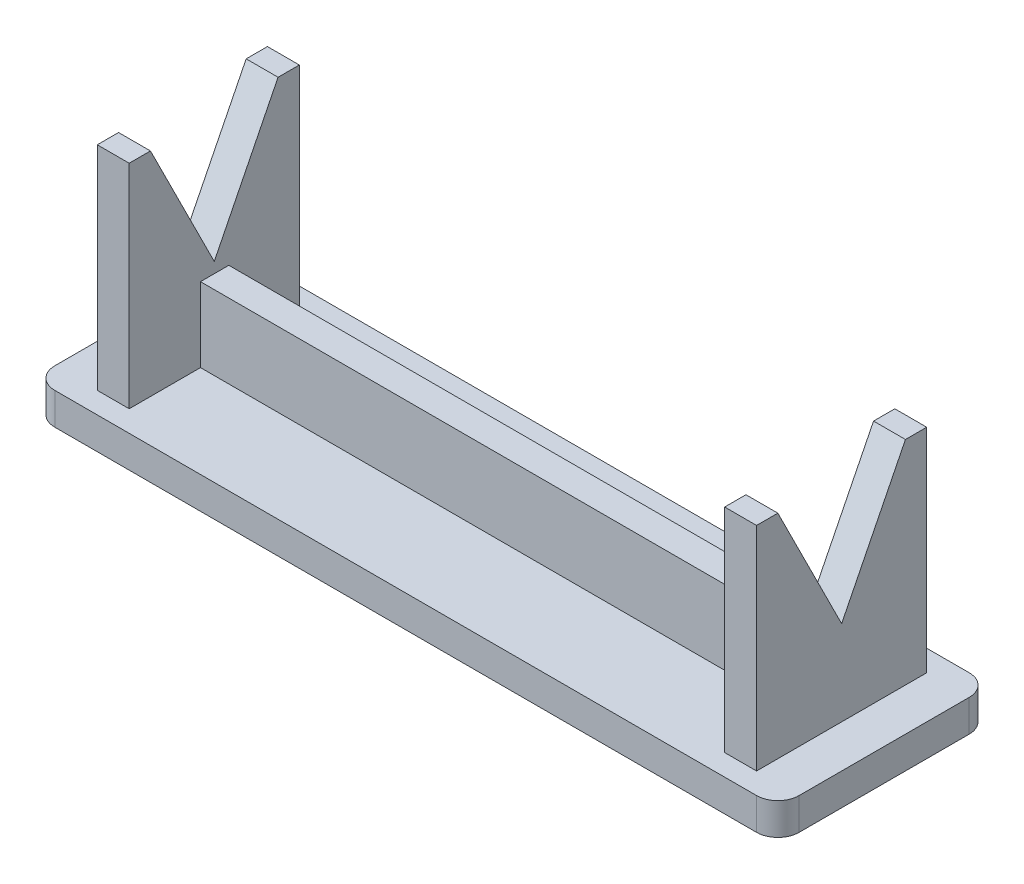
ISO-10303-21;
HEADER;
FILE_DESCRIPTION(('STEP AP214'),'2;1');
FILE_NAME('part.step','',(''),(''),'','','');
FILE_SCHEMA(('AUTOMOTIVE_DESIGN { 1 0 10303 214 1 1 1 1 }'));
ENDSEC;
DATA;
#1=APPLICATION_CONTEXT('core data for automotive mechanical design processes');
#2=APPLICATION_PROTOCOL_DEFINITION('international standard','automotive_design',2000,#1);
#3=PRODUCT_CONTEXT('',#1,'mechanical');
#4=PRODUCT('Part','Part','',(#3));
#5=PRODUCT_RELATED_PRODUCT_CATEGORY('part','',(#4));
#6=PRODUCT_DEFINITION_FORMATION('','',#4);
#7=PRODUCT_DEFINITION_CONTEXT('part definition',#1,'design');
#8=PRODUCT_DEFINITION('design','',#6,#7);
#9=PRODUCT_DEFINITION_SHAPE('','',#8);
#10=(LENGTH_UNIT() NAMED_UNIT(*) SI_UNIT(.MILLI.,.METRE.));
#11=(NAMED_UNIT(*) PLANE_ANGLE_UNIT() SI_UNIT($,.RADIAN.));
#12=(NAMED_UNIT(*) SI_UNIT($,.STERADIAN.) SOLID_ANGLE_UNIT());
#13=UNCERTAINTY_MEASURE_WITH_UNIT(LENGTH_MEASURE(1.E-05),#10,'distance_accuracy_value','');
#14=(GEOMETRIC_REPRESENTATION_CONTEXT(3) GLOBAL_UNCERTAINTY_ASSIGNED_CONTEXT((#13)) GLOBAL_UNIT_ASSIGNED_CONTEXT((#10,
#11,#12)) REPRESENTATION_CONTEXT('',''));
#15=CARTESIAN_POINT('',(0.,0.,0.));
#16=DIRECTION('',(0.,0.,1.));
#17=DIRECTION('',(1.,0.,0.));
#18=AXIS2_PLACEMENT_3D('',#15,#16,#17);
#19=CARTESIAN_POINT('',(68.,3.,-18.));
#20=DIRECTION('',(0.,-1.,0.));
#21=DIRECTION('',(0.,0.,-1.));
#22=AXIS2_PLACEMENT_3D('',#19,#20,#21);
#23=PLANE('',#22);
#24=CARTESIAN_POINT('',(68.,3.,-18.));
#25=DIRECTION('',(0.,1.,0.));
#26=DIRECTION('',(0.,0.,-1.));
#27=AXIS2_PLACEMENT_3D('',#24,#25,#26);
#28=CIRCLE('',#27,2.);
#29=CARTESIAN_POINT('',(70.,3.,-18.));
#30=VERTEX_POINT('',#29);
#31=CARTESIAN_POINT('',(68.,3.,-20.));
#32=VERTEX_POINT('',#31);
#33=EDGE_CURVE('E342',#30,#32,#28,.T.);
#34=ORIENTED_EDGE('',*,*,#33,.T.);
#35=DIRECTION('',(-1.,0.,0.));
#36=VECTOR('',#35,1.);
#37=CARTESIAN_POINT('',(2.,3.,-20.));
#38=LINE('',#37,#36);
#39=CARTESIAN_POINT('',(2.,3.,-20.));
#40=VERTEX_POINT('',#39);
#41=EDGE_CURVE('E345',#32,#40,#38,.T.);
#42=ORIENTED_EDGE('',*,*,#41,.T.);
#43=CARTESIAN_POINT('',(1.99999999999999,3.,-18.));
#44=DIRECTION('',(0.,1.,0.));
#45=DIRECTION('',(0.,0.,1.));
#46=AXIS2_PLACEMENT_3D('',#43,#44,#45);
#47=CIRCLE('',#46,2.);
#48=CARTESIAN_POINT('',(0.,3.,-18.));
#49=VERTEX_POINT('',#48);
#50=EDGE_CURVE('E348',#40,#49,#47,.T.);
#51=ORIENTED_EDGE('',*,*,#50,.T.);
#52=DIRECTION('',(0.,0.,1.));
#53=VECTOR('',#52,1.);
#54=CARTESIAN_POINT('',(0.,3.,-2.00000000000001));
#55=LINE('',#54,#53);
#56=CARTESIAN_POINT('',(0.,3.,-2.00000000000001));
#57=VERTEX_POINT('',#56);
#58=EDGE_CURVE('E350',#49,#57,#55,.T.);
#59=ORIENTED_EDGE('',*,*,#58,.T.);
#60=CARTESIAN_POINT('',(2.,3.,-2.));
#61=DIRECTION('',(0.,1.,0.));
#62=DIRECTION('',(0.,0.,-1.));
#63=AXIS2_PLACEMENT_3D('',#60,#61,#62);
#64=CIRCLE('',#63,2.);
#65=CARTESIAN_POINT('',(2.00000000000001,3.,0.));
#66=VERTEX_POINT('',#65);
#67=EDGE_CURVE('E352',#57,#66,#64,.T.);
#68=ORIENTED_EDGE('',*,*,#67,.T.);
#69=DIRECTION('',(1.,0.,0.));
#70=VECTOR('',#69,1.);
#71=CARTESIAN_POINT('',(2.00000000000001,3.,0.));
#72=LINE('',#71,#70);
#73=CARTESIAN_POINT('',(68.,3.,0.));
#74=VERTEX_POINT('',#73);
#75=EDGE_CURVE('E354',#66,#74,#72,.T.);
#76=ORIENTED_EDGE('',*,*,#75,.T.);
#77=CARTESIAN_POINT('',(68.,3.,-2.00000000000001));
#78=DIRECTION('',(0.,1.,0.));
#79=DIRECTION('',(0.,0.,1.));
#80=AXIS2_PLACEMENT_3D('',#77,#78,#79);
#81=CIRCLE('',#80,2.);
#82=CARTESIAN_POINT('',(70.,3.,-2.00000000000002));
#83=VERTEX_POINT('',#82);
#84=EDGE_CURVE('E356',#74,#83,#81,.T.);
#85=ORIENTED_EDGE('',*,*,#84,.T.);
#86=DIRECTION('',(0.,0.,-1.));
#87=VECTOR('',#86,1.);
#88=CARTESIAN_POINT('',(70.,3.,-2.00000000000002));
#89=LINE('',#88,#87);
#90=EDGE_CURVE('E358',#83,#30,#89,.T.);
#91=ORIENTED_EDGE('',*,*,#90,.T.);
#92=EDGE_LOOP('',(#34,#42,#51,#59,#68,#76,#85,#91));
#93=FACE_BOUND('',#92,.T.);
#94=DIRECTION('',(1.,0.,0.));
#95=VECTOR('',#94,1.);
#96=CARTESIAN_POINT('',(6.99999999999998,3.,-8.7034388832141));
#97=LINE('',#96,#95);
#98=CARTESIAN_POINT('',(6.99999999999998,3.,-8.7034388832141));
#99=VERTEX_POINT('',#98);
#100=CARTESIAN_POINT('',(63.,3.,-8.7034388832141));
#101=VERTEX_POINT('',#100);
#102=EDGE_CURVE('E708',#99,#101,#97,.T.);
#103=ORIENTED_EDGE('',*,*,#102,.F.);
#104=DIRECTION('',(0.,0.,-1.));
#105=VECTOR('',#104,1.);
#106=CARTESIAN_POINT('',(6.99999999999998,3.,-18.));
#107=LINE('',#106,#105);
#108=CARTESIAN_POINT('',(6.99999999999998,3.,-2.));
#109=VERTEX_POINT('',#108);
#110=EDGE_CURVE('E231',#109,#99,#107,.T.);
#111=ORIENTED_EDGE('',*,*,#110,.F.);
#112=DIRECTION('',(1.,0.,0.));
#113=VECTOR('',#112,1.);
#114=CARTESIAN_POINT('',(3.99999999999999,3.,-2.));
#115=LINE('',#114,#113);
#116=CARTESIAN_POINT('',(3.99999999999999,3.,-2.));
#117=VERTEX_POINT('',#116);
#118=EDGE_CURVE('E323',#117,#109,#115,.T.);
#119=ORIENTED_EDGE('',*,*,#118,.F.);
#120=DIRECTION('',(0.,0.,1.));
#121=VECTOR('',#120,1.);
#122=CARTESIAN_POINT('',(3.99999999999999,3.,-18.));
#123=LINE('',#122,#121);
#124=CARTESIAN_POINT('',(3.99999999999999,3.,-18.));
#125=VERTEX_POINT('',#124);
#126=EDGE_CURVE('E307',#125,#117,#123,.T.);
#127=ORIENTED_EDGE('',*,*,#126,.F.);
#128=DIRECTION('',(-1.,0.,0.));
#129=VECTOR('',#128,1.);
#130=CARTESIAN_POINT('',(3.99999999999999,3.,-18.));
#131=LINE('',#130,#129);
#132=CARTESIAN_POINT('',(6.99999999999998,3.,-18.));
#133=VERTEX_POINT('',#132);
#134=EDGE_CURVE('E328',#133,#125,#131,.T.);
#135=ORIENTED_EDGE('',*,*,#134,.F.);
#136=CARTESIAN_POINT('',(6.99999999999998,3.,-11.3685922899405));
#137=VERTEX_POINT('',#136);
#138=EDGE_CURVE('E326',#137,#133,#107,.T.);
#139=ORIENTED_EDGE('',*,*,#138,.F.);
#140=DIRECTION('',(-1.,0.,0.));
#141=VECTOR('',#140,1.);
#142=CARTESIAN_POINT('',(6.99999999999998,3.,-11.3685922899405));
#143=LINE('',#142,#141);
#144=CARTESIAN_POINT('',(63.,3.,-11.3685922899405));
#145=VERTEX_POINT('',#144);
#146=EDGE_CURVE('E226',#145,#137,#143,.T.);
#147=ORIENTED_EDGE('',*,*,#146,.F.);
#148=DIRECTION('',(0.,0.,1.));
#149=VECTOR('',#148,1.);
#150=CARTESIAN_POINT('',(63.,3.,-18.));
#151=LINE('',#150,#149);
#152=CARTESIAN_POINT('',(63.,3.,-18.));
#153=VERTEX_POINT('',#152);
#154=EDGE_CURVE('E266',#153,#145,#151,.T.);
#155=ORIENTED_EDGE('',*,*,#154,.F.);
#156=DIRECTION('',(-1.,0.,0.));
#157=VECTOR('',#156,1.);
#158=CARTESIAN_POINT('',(63.,3.,-18.));
#159=LINE('',#158,#157);
#160=CARTESIAN_POINT('',(66.,3.,-18.));
#161=VERTEX_POINT('',#160);
#162=EDGE_CURVE('E275',#161,#153,#159,.T.);
#163=ORIENTED_EDGE('',*,*,#162,.F.);
#164=DIRECTION('',(0.,0.,-1.));
#165=VECTOR('',#164,1.);
#166=CARTESIAN_POINT('',(66.,3.,-18.));
#167=LINE('',#166,#165);
#168=CARTESIAN_POINT('',(66.,3.,-2.));
#169=VERTEX_POINT('',#168);
#170=EDGE_CURVE('E272',#169,#161,#167,.T.);
#171=ORIENTED_EDGE('',*,*,#170,.F.);
#172=DIRECTION('',(1.,0.,0.));
#173=VECTOR('',#172,1.);
#174=CARTESIAN_POINT('',(63.,3.,-2.));
#175=LINE('',#174,#173);
#176=CARTESIAN_POINT('',(63.,3.,-2.));
#177=VERTEX_POINT('',#176);
#178=EDGE_CURVE('E269',#177,#169,#175,.T.);
#179=ORIENTED_EDGE('',*,*,#178,.F.);
#180=EDGE_CURVE('E252',#101,#177,#151,.T.);
#181=ORIENTED_EDGE('',*,*,#180,.F.);
#182=EDGE_LOOP('',(#103,#111,#119,#127,#135,#139,#147,#155,#163,#171,#179,#181));
#183=FACE_BOUND('',#182,.T.);
#184=ADVANCED_FACE('F37',(#93,#183),#23,.F.);
#185=CARTESIAN_POINT('',(6.99999999999998,23.,-18.));
#186=DIRECTION('',(-1.,0.,0.));
#187=DIRECTION('',(0.,0.,1.));
#188=AXIS2_PLACEMENT_3D('',#185,#186,#187);
#189=PLANE('',#188);
#190=DIRECTION('',(0.,-1.,0.));
#191=VECTOR('',#190,1.);
#192=CARTESIAN_POINT('',(6.99999999999998,10.,-8.7034388832141));
#193=LINE('',#192,#191);
#194=CARTESIAN_POINT('',(6.99999999999998,10.,-8.7034388832141));
#195=VERTEX_POINT('',#194);
#196=EDGE_CURVE('E212',#195,#99,#193,.T.);
#197=ORIENTED_EDGE('',*,*,#196,.F.);
#198=DIRECTION('',(0.,0.,1.));
#199=VECTOR('',#198,1.);
#200=CARTESIAN_POINT('',(6.99999999999998,10.,-11.3685922899405));
#201=LINE('',#200,#199);
#202=CARTESIAN_POINT('',(6.99999999999998,10.,-11.3685922899405));
#203=VERTEX_POINT('',#202);
#204=EDGE_CURVE('E217',#203,#195,#201,.T.);
#205=ORIENTED_EDGE('',*,*,#204,.F.);
#206=DIRECTION('',(0.,-1.,0.));
#207=VECTOR('',#206,1.);
#208=CARTESIAN_POINT('',(6.99999999999998,10.,-11.3685922899405));
#209=LINE('',#208,#207);
#210=EDGE_CURVE('E715',#203,#137,#209,.T.);
#211=ORIENTED_EDGE('',*,*,#210,.T.);
#212=ORIENTED_EDGE('',*,*,#138,.T.);
#213=DIRECTION('',(0.,-1.,0.));
#214=VECTOR('',#213,1.);
#215=CARTESIAN_POINT('',(6.99999999999998,23.,-18.));
#216=LINE('',#215,#214);
#217=CARTESIAN_POINT('',(6.99999999999998,23.,-18.));
#218=VERTEX_POINT('',#217);
#219=EDGE_CURVE('E333',#218,#133,#216,.T.);
#220=ORIENTED_EDGE('',*,*,#219,.F.);
#221=DIRECTION('',(0.,0.,-1.));
#222=VECTOR('',#221,1.);
#223=CARTESIAN_POINT('',(6.99999999999998,23.,-18.));
#224=LINE('',#223,#222);
#225=CARTESIAN_POINT('',(6.99999999999998,23.,-16.));
#226=VERTEX_POINT('',#225);
#227=EDGE_CURVE('E314',#226,#218,#224,.T.);
#228=ORIENTED_EDGE('',*,*,#227,.F.);
#229=DIRECTION('',(0.,0.894427190999916,-0.447213595499958));
#230=VECTOR('',#229,1.);
#231=CARTESIAN_POINT('',(6.99999999999998,23.,-16.));
#232=LINE('',#231,#230);
#233=CARTESIAN_POINT('',(6.99999999999996,11.,-10.));
#234=VERTEX_POINT('',#233);
#235=EDGE_CURVE('E293',#234,#226,#232,.T.);
#236=ORIENTED_EDGE('',*,*,#235,.F.);
#237=DIRECTION('',(0.,-0.894427190999916,-0.447213595499958));
#238=VECTOR('',#237,1.);
#239=CARTESIAN_POINT('',(6.99999999999998,11.,-10.));
#240=LINE('',#239,#238);
#241=CARTESIAN_POINT('',(6.99999999999996,23.,-4.));
#242=VERTEX_POINT('',#241);
#243=EDGE_CURVE('E290',#242,#234,#240,.T.);
#244=ORIENTED_EDGE('',*,*,#243,.F.);
#245=CARTESIAN_POINT('',(6.99999999999998,23.,-2.));
#246=VERTEX_POINT('',#245);
#247=EDGE_CURVE('E315',#246,#242,#224,.T.);
#248=ORIENTED_EDGE('',*,*,#247,.F.);
#249=DIRECTION('',(0.,-1.,0.));
#250=VECTOR('',#249,1.);
#251=CARTESIAN_POINT('',(6.99999999999998,23.,-2.));
#252=LINE('',#251,#250);
#253=EDGE_CURVE('E336',#246,#109,#252,.T.);
#254=ORIENTED_EDGE('',*,*,#253,.T.);
#255=ORIENTED_EDGE('',*,*,#110,.T.);
#256=EDGE_LOOP('',(#197,#205,#211,#212,#220,#228,#236,#244,#248,#254,#255));
#257=FACE_BOUND('',#256,.T.);
#258=ADVANCED_FACE('F229',(#257),#189,.F.);
#259=CARTESIAN_POINT('',(63.,23.,-18.));
#260=DIRECTION('',(1.,0.,0.));
#261=DIRECTION('',(0.,0.,-1.));
#262=AXIS2_PLACEMENT_3D('',#259,#260,#261);
#263=PLANE('',#262);
#264=DIRECTION('',(0.,-1.,0.));
#265=VECTOR('',#264,1.);
#266=CARTESIAN_POINT('',(63.,10.,-8.7034388832141));
#267=LINE('',#266,#265);
#268=CARTESIAN_POINT('',(63.,10.,-8.7034388832141));
#269=VERTEX_POINT('',#268);
#270=EDGE_CURVE('E52',#269,#101,#267,.T.);
#271=ORIENTED_EDGE('',*,*,#270,.T.);
#272=ORIENTED_EDGE('',*,*,#180,.T.);
#273=DIRECTION('',(0.,-1.,0.));
#274=VECTOR('',#273,1.);
#275=CARTESIAN_POINT('',(63.,23.,-2.));
#276=LINE('',#275,#274);
#277=CARTESIAN_POINT('',(63.,23.,-2.));
#278=VERTEX_POINT('',#277);
#279=EDGE_CURVE('E286',#278,#177,#276,.T.);
#280=ORIENTED_EDGE('',*,*,#279,.F.);
#281=DIRECTION('',(0.,0.,1.));
#282=VECTOR('',#281,1.);
#283=CARTESIAN_POINT('',(63.,23.,-18.));
#284=LINE('',#283,#282);
#285=CARTESIAN_POINT('',(63.,23.,-4.));
#286=VERTEX_POINT('',#285);
#287=EDGE_CURVE('E257',#286,#278,#284,.T.);
#288=ORIENTED_EDGE('',*,*,#287,.F.);
#289=DIRECTION('',(0.,-0.894427190999916,-0.447213595499958));
#290=VECTOR('',#289,1.);
#291=CARTESIAN_POINT('',(63.,11.,-10.));
#292=LINE('',#291,#290);
#293=CARTESIAN_POINT('',(63.,11.,-10.));
#294=VERTEX_POINT('',#293);
#295=EDGE_CURVE('E232',#286,#294,#292,.T.);
#296=ORIENTED_EDGE('',*,*,#295,.T.);
#297=DIRECTION('',(0.,0.894427190999916,-0.447213595499958));
#298=VECTOR('',#297,1.);
#299=CARTESIAN_POINT('',(63.,23.,-16.));
#300=LINE('',#299,#298);
#301=CARTESIAN_POINT('',(63.,23.,-16.));
#302=VERTEX_POINT('',#301);
#303=EDGE_CURVE('E235',#294,#302,#300,.T.);
#304=ORIENTED_EDGE('',*,*,#303,.T.);
#305=CARTESIAN_POINT('',(63.,23.,-18.));
#306=VERTEX_POINT('',#305);
#307=EDGE_CURVE('E253',#306,#302,#284,.T.);
#308=ORIENTED_EDGE('',*,*,#307,.F.);
#309=DIRECTION('',(0.,-1.,0.));
#310=VECTOR('',#309,1.);
#311=CARTESIAN_POINT('',(63.,23.,-18.));
#312=LINE('',#311,#310);
#313=EDGE_CURVE('E265',#306,#153,#312,.T.);
#314=ORIENTED_EDGE('',*,*,#313,.T.);
#315=ORIENTED_EDGE('',*,*,#154,.T.);
#316=DIRECTION('',(0.,-1.,0.));
#317=VECTOR('',#316,1.);
#318=CARTESIAN_POINT('',(63.,10.,-11.3685922899405));
#319=LINE('',#318,#317);
#320=CARTESIAN_POINT('',(63.,10.,-11.3685922899405));
#321=VERTEX_POINT('',#320);
#322=EDGE_CURVE('E237',#321,#145,#319,.T.);
#323=ORIENTED_EDGE('',*,*,#322,.F.);
#324=DIRECTION('',(0.,0.,-1.));
#325=VECTOR('',#324,1.);
#326=CARTESIAN_POINT('',(63.,10.,-11.3685922899405));
#327=LINE('',#326,#325);
#328=EDGE_CURVE('E216',#269,#321,#327,.T.);
#329=ORIENTED_EDGE('',*,*,#328,.F.);
#330=EDGE_LOOP('',(#271,#272,#280,#288,#296,#304,#308,#314,#315,#323,#329));
#331=FACE_BOUND('',#330,.T.);
#332=ADVANCED_FACE('F447',(#331),#263,.F.);
#333=CARTESIAN_POINT('',(66.,23.,-18.));
#334=DIRECTION('',(-1.,0.,0.));
#335=DIRECTION('',(0.,0.,1.));
#336=AXIS2_PLACEMENT_3D('',#333,#334,#335);
#337=PLANE('',#336);
#338=DIRECTION('',(0.,0.894427190999916,-0.447213595499958));
#339=VECTOR('',#338,1.);
#340=CARTESIAN_POINT('',(66.,23.,-16.));
#341=LINE('',#340,#339);
#342=CARTESIAN_POINT('',(66.,11.,-10.));
#343=VERTEX_POINT('',#342);
#344=CARTESIAN_POINT('',(66.,23.,-16.));
#345=VERTEX_POINT('',#344);
#346=EDGE_CURVE('E60',#343,#345,#341,.T.);
#347=ORIENTED_EDGE('',*,*,#346,.F.);
#348=DIRECTION('',(0.,-0.894427190999916,-0.447213595499958));
#349=VECTOR('',#348,1.);
#350=CARTESIAN_POINT('',(66.,11.,-10.));
#351=LINE('',#350,#349);
#352=CARTESIAN_POINT('',(66.,23.,-4.));
#353=VERTEX_POINT('',#352);
#354=EDGE_CURVE('E241',#353,#343,#351,.T.);
#355=ORIENTED_EDGE('',*,*,#354,.F.);
#356=DIRECTION('',(0.,0.,-1.));
#357=VECTOR('',#356,1.);
#358=CARTESIAN_POINT('',(66.,23.,-18.));
#359=LINE('',#358,#357);
#360=CARTESIAN_POINT('',(66.,23.,-2.));
#361=VERTEX_POINT('',#360);
#362=EDGE_CURVE('E260',#361,#353,#359,.T.);
#363=ORIENTED_EDGE('',*,*,#362,.F.);
#364=DIRECTION('',(0.,-1.,0.));
#365=VECTOR('',#364,1.);
#366=CARTESIAN_POINT('',(66.,23.,-2.));
#367=LINE('',#366,#365);
#368=EDGE_CURVE('E283',#361,#169,#367,.T.);
#369=ORIENTED_EDGE('',*,*,#368,.T.);
#370=ORIENTED_EDGE('',*,*,#170,.T.);
#371=DIRECTION('',(0.,-1.,0.));
#372=VECTOR('',#371,1.);
#373=CARTESIAN_POINT('',(66.,23.,-18.));
#374=LINE('',#373,#372);
#375=CARTESIAN_POINT('',(66.,23.,-18.));
#376=VERTEX_POINT('',#375);
#377=EDGE_CURVE('E280',#376,#161,#374,.T.);
#378=ORIENTED_EDGE('',*,*,#377,.F.);
#379=EDGE_CURVE('E259',#345,#376,#359,.T.);
#380=ORIENTED_EDGE('',*,*,#379,.F.);
#381=EDGE_LOOP('',(#347,#355,#363,#369,#370,#378,#380));
#382=FACE_BOUND('',#381,.T.);
#383=ADVANCED_FACE('F595',(#382),#337,.F.);
#384=CARTESIAN_POINT('',(0.,23.,0.));
#385=DIRECTION('',(0.,1.,0.));
#386=DIRECTION('',(0.,0.,1.));
#387=AXIS2_PLACEMENT_3D('',#384,#385,#386);
#388=PLANE('',#387);
#389=ORIENTED_EDGE('',*,*,#307,.T.);
#390=DIRECTION('',(1.,0.,0.));
#391=VECTOR('',#390,1.);
#392=CARTESIAN_POINT('',(-38.684859983132,23.,-16.));
#393=LINE('',#392,#391);
#394=EDGE_CURVE('E243',#302,#345,#393,.T.);
#395=ORIENTED_EDGE('',*,*,#394,.T.);
#396=ORIENTED_EDGE('',*,*,#379,.T.);
#397=DIRECTION('',(-1.,0.,0.));
#398=VECTOR('',#397,1.);
#399=CARTESIAN_POINT('',(63.,23.,-18.));
#400=LINE('',#399,#398);
#401=EDGE_CURVE('E263',#376,#306,#400,.T.);
#402=ORIENTED_EDGE('',*,*,#401,.T.);
#403=EDGE_LOOP('',(#389,#395,#396,#402));
#404=FACE_BOUND('',#403,.T.);
#405=ADVANCED_FACE('F538',(#404),#388,.T.);
#406=CARTESIAN_POINT('',(0.,23.,0.));
#407=DIRECTION('',(0.,1.,0.));
#408=DIRECTION('',(0.,0.,1.));
#409=AXIS2_PLACEMENT_3D('',#406,#407,#408);
#410=PLANE('',#409);
#411=DIRECTION('',(0.,0.,1.));
#412=VECTOR('',#411,1.);
#413=CARTESIAN_POINT('',(3.99999999999999,23.,-18.));
#414=LINE('',#413,#412);
#415=CARTESIAN_POINT('',(3.99999999999999,23.,-18.));
#416=VERTEX_POINT('',#415);
#417=CARTESIAN_POINT('',(3.99999999999995,23.,-16.));
#418=VERTEX_POINT('',#417);
#419=EDGE_CURVE('E308',#416,#418,#414,.T.);
#420=ORIENTED_EDGE('',*,*,#419,.T.);
#421=DIRECTION('',(1.,0.,0.));
#422=VECTOR('',#421,1.);
#423=CARTESIAN_POINT('',(-171.434859983132,23.,-16.));
#424=LINE('',#423,#422);
#425=EDGE_CURVE('E292',#418,#226,#424,.T.);
#426=ORIENTED_EDGE('',*,*,#425,.T.);
#427=ORIENTED_EDGE('',*,*,#227,.T.);
#428=DIRECTION('',(-1.,0.,0.));
#429=VECTOR('',#428,1.);
#430=CARTESIAN_POINT('',(3.99999999999999,23.,-18.));
#431=LINE('',#430,#429);
#432=EDGE_CURVE('E318',#218,#416,#431,.T.);
#433=ORIENTED_EDGE('',*,*,#432,.T.);
#434=EDGE_LOOP('',(#420,#426,#427,#433));
#435=FACE_BOUND('',#434,.T.);
#436=ADVANCED_FACE('F496',(#435),#410,.T.);
#437=CARTESIAN_POINT('',(68.,3.,-18.));
#438=DIRECTION('',(0.,-1.,0.));
#439=DIRECTION('',(0.,0.,-1.));
#440=AXIS2_PLACEMENT_3D('',#437,#438,#439);
#441=CYLINDRICAL_SURFACE('',#440,2.);
#442=CARTESIAN_POINT('',(68.,0.,-18.));
#443=DIRECTION('',(0.,1.,0.));
#444=DIRECTION('',(0.,0.,-1.));
#445=AXIS2_PLACEMENT_3D('',#442,#443,#444);
#446=CIRCLE('',#445,2.);
#447=CARTESIAN_POINT('',(70.,0.,-18.));
#448=VERTEX_POINT('',#447);
#449=CARTESIAN_POINT('',(68.,0.,-20.));
#450=VERTEX_POINT('',#449);
#451=EDGE_CURVE('E341',#448,#450,#446,.T.);
#452=ORIENTED_EDGE('',*,*,#451,.T.);
#453=DIRECTION('',(0.,-1.,0.));
#454=VECTOR('',#453,1.);
#455=CARTESIAN_POINT('',(68.,3.,-20.));
#456=LINE('',#455,#454);
#457=EDGE_CURVE('E11',#32,#450,#456,.T.);
#458=ORIENTED_EDGE('',*,*,#457,.F.);
#459=ORIENTED_EDGE('',*,*,#33,.F.);
#460=DIRECTION('',(0.,-1.,0.));
#461=VECTOR('',#460,1.);
#462=CARTESIAN_POINT('',(70.,3.,-18.));
#463=LINE('',#462,#461);
#464=EDGE_CURVE('E360',#30,#448,#463,.T.);
#465=ORIENTED_EDGE('',*,*,#464,.T.);
#466=EDGE_LOOP('',(#452,#458,#459,#465));
#467=FACE_BOUND('',#466,.T.);
#468=ADVANCED_FACE('F39',(#467),#441,.T.);
#469=CARTESIAN_POINT('',(2.,3.,-20.));
#470=DIRECTION('',(0.,0.,1.));
#471=DIRECTION('',(1.,0.,0.));
#472=AXIS2_PLACEMENT_3D('',#469,#470,#471);
#473=PLANE('',#472);
#474=DIRECTION('',(-1.,0.,0.));
#475=VECTOR('',#474,1.);
#476=CARTESIAN_POINT('',(2.,0.,-20.));
#477=LINE('',#476,#475);
#478=CARTESIAN_POINT('',(2.,0.,-20.));
#479=VERTEX_POINT('',#478);
#480=EDGE_CURVE('E363',#450,#479,#477,.T.);
#481=ORIENTED_EDGE('',*,*,#480,.T.);
#482=DIRECTION('',(0.,-1.,0.));
#483=VECTOR('',#482,1.);
#484=CARTESIAN_POINT('',(2.,3.,-20.));
#485=LINE('',#484,#483);
#486=EDGE_CURVE('E45',#40,#479,#485,.T.);
#487=ORIENTED_EDGE('',*,*,#486,.F.);
#488=ORIENTED_EDGE('',*,*,#41,.F.);
#489=ORIENTED_EDGE('',*,*,#457,.T.);
#490=EDGE_LOOP('',(#481,#487,#488,#489));
#491=FACE_BOUND('',#490,.T.);
#492=ADVANCED_FACE('F420',(#491),#473,.F.);
#493=CARTESIAN_POINT('',(1.99999999999999,3.,-18.));
#494=DIRECTION('',(0.,-1.,0.));
#495=DIRECTION('',(0.,0.,-1.));
#496=AXIS2_PLACEMENT_3D('',#493,#494,#495);
#497=CYLINDRICAL_SURFACE('',#496,2.);
#498=CARTESIAN_POINT('',(1.99999999999999,0.,-18.));
#499=DIRECTION('',(0.,1.,0.));
#500=DIRECTION('',(0.,0.,1.));
#501=AXIS2_PLACEMENT_3D('',#498,#499,#500);
#502=CIRCLE('',#501,2.);
#503=CARTESIAN_POINT('',(0.,0.,-18.));
#504=VERTEX_POINT('',#503);
#505=EDGE_CURVE('E365',#479,#504,#502,.T.);
#506=ORIENTED_EDGE('',*,*,#505,.T.);
#507=DIRECTION('',(0.,-1.,0.));
#508=VECTOR('',#507,1.);
#509=CARTESIAN_POINT('',(0.,3.,-18.));
#510=LINE('',#509,#508);
#511=EDGE_CURVE('E390',#49,#504,#510,.T.);
#512=ORIENTED_EDGE('',*,*,#511,.F.);
#513=ORIENTED_EDGE('',*,*,#50,.F.);
#514=ORIENTED_EDGE('',*,*,#486,.T.);
#515=EDGE_LOOP('',(#506,#512,#513,#514));
#516=FACE_BOUND('',#515,.T.);
#517=ADVANCED_FACE('F397',(#516),#497,.T.);
#518=CARTESIAN_POINT('',(0.,3.,-2.00000000000001));
#519=DIRECTION('',(1.,0.,0.));
#520=DIRECTION('',(0.,0.,-1.));
#521=AXIS2_PLACEMENT_3D('',#518,#519,#520);
#522=PLANE('',#521);
#523=DIRECTION('',(0.,0.,1.));
#524=VECTOR('',#523,1.);
#525=CARTESIAN_POINT('',(0.,0.,-2.00000000000001));
#526=LINE('',#525,#524);
#527=CARTESIAN_POINT('',(0.,0.,-2.00000000000001));
#528=VERTEX_POINT('',#527);
#529=EDGE_CURVE('E367',#504,#528,#526,.T.);
#530=ORIENTED_EDGE('',*,*,#529,.T.);
#531=DIRECTION('',(0.,-1.,0.));
#532=VECTOR('',#531,1.);
#533=CARTESIAN_POINT('',(0.,3.,-2.00000000000001));
#534=LINE('',#533,#532);
#535=EDGE_CURVE('E387',#57,#528,#534,.T.);
#536=ORIENTED_EDGE('',*,*,#535,.F.);
#537=ORIENTED_EDGE('',*,*,#58,.F.);
#538=ORIENTED_EDGE('',*,*,#511,.T.);
#539=EDGE_LOOP('',(#530,#536,#537,#538));
#540=FACE_BOUND('',#539,.T.);
#541=ADVANCED_FACE('F408',(#540),#522,.F.);
#542=CARTESIAN_POINT('',(2.,3.,-2.));
#543=DIRECTION('',(0.,-1.,0.));
#544=DIRECTION('',(0.,0.,-1.));
#545=AXIS2_PLACEMENT_3D('',#542,#543,#544);
#546=CYLINDRICAL_SURFACE('',#545,2.);
#547=CARTESIAN_POINT('',(2.,0.,-2.));
#548=DIRECTION('',(0.,1.,0.));
#549=DIRECTION('',(0.,0.,-1.));
#550=AXIS2_PLACEMENT_3D('',#547,#548,#549);
#551=CIRCLE('',#550,2.);
#552=CARTESIAN_POINT('',(2.00000000000001,0.,0.));
#553=VERTEX_POINT('',#552);
#554=EDGE_CURVE('E369',#528,#553,#551,.T.);
#555=ORIENTED_EDGE('',*,*,#554,.T.);
#556=DIRECTION('',(0.,-1.,0.));
#557=VECTOR('',#556,1.);
#558=CARTESIAN_POINT('',(2.00000000000001,3.,0.));
#559=LINE('',#558,#557);
#560=EDGE_CURVE('E384',#66,#553,#559,.T.);
#561=ORIENTED_EDGE('',*,*,#560,.F.);
#562=ORIENTED_EDGE('',*,*,#67,.F.);
#563=ORIENTED_EDGE('',*,*,#535,.T.);
#564=EDGE_LOOP('',(#555,#561,#562,#563));
#565=FACE_BOUND('',#564,.T.);
#566=ADVANCED_FACE('F412',(#565),#546,.T.);
#567=CARTESIAN_POINT('',(2.00000000000001,3.,0.));
#568=DIRECTION('',(0.,0.,-1.));
#569=DIRECTION('',(-1.,0.,0.));
#570=AXIS2_PLACEMENT_3D('',#567,#568,#569);
#571=PLANE('',#570);
#572=DIRECTION('',(1.,0.,0.));
#573=VECTOR('',#572,1.);
#574=CARTESIAN_POINT('',(2.00000000000001,0.,0.));
#575=LINE('',#574,#573);
#576=CARTESIAN_POINT('',(68.,0.,0.));
#577=VERTEX_POINT('',#576);
#578=EDGE_CURVE('E371',#553,#577,#575,.T.);
#579=ORIENTED_EDGE('',*,*,#578,.T.);
#580=DIRECTION('',(0.,-1.,0.));
#581=VECTOR('',#580,1.);
#582=CARTESIAN_POINT('',(68.,3.,0.));
#583=LINE('',#582,#581);
#584=EDGE_CURVE('E381',#74,#577,#583,.T.);
#585=ORIENTED_EDGE('',*,*,#584,.F.);
#586=ORIENTED_EDGE('',*,*,#75,.F.);
#587=ORIENTED_EDGE('',*,*,#560,.T.);
#588=EDGE_LOOP('',(#579,#585,#586,#587));
#589=FACE_BOUND('',#588,.T.);
#590=ADVANCED_FACE('F433',(#589),#571,.F.);
#591=CARTESIAN_POINT('',(68.,3.,-2.00000000000001));
#592=DIRECTION('',(0.,-1.,0.));
#593=DIRECTION('',(0.,0.,-1.));
#594=AXIS2_PLACEMENT_3D('',#591,#592,#593);
#595=CYLINDRICAL_SURFACE('',#594,2.);
#596=CARTESIAN_POINT('',(68.,0.,-2.00000000000001));
#597=DIRECTION('',(0.,1.,0.));
#598=DIRECTION('',(0.,0.,1.));
#599=AXIS2_PLACEMENT_3D('',#596,#597,#598);
#600=CIRCLE('',#599,2.);
#601=CARTESIAN_POINT('',(70.,0.,-2.00000000000002));
#602=VERTEX_POINT('',#601);
#603=EDGE_CURVE('E373',#577,#602,#600,.T.);
#604=ORIENTED_EDGE('',*,*,#603,.T.);
#605=DIRECTION('',(0.,-1.,0.));
#606=VECTOR('',#605,1.);
#607=CARTESIAN_POINT('',(70.,3.,-2.00000000000002));
#608=LINE('',#607,#606);
#609=EDGE_CURVE('E378',#83,#602,#608,.T.);
#610=ORIENTED_EDGE('',*,*,#609,.F.);
#611=ORIENTED_EDGE('',*,*,#84,.F.);
#612=ORIENTED_EDGE('',*,*,#584,.T.);
#613=EDGE_LOOP('',(#604,#610,#611,#612));
#614=FACE_BOUND('',#613,.T.);
#615=ADVANCED_FACE('F431',(#614),#595,.T.);
#616=CARTESIAN_POINT('',(70.,3.,-2.00000000000002));
#617=DIRECTION('',(-1.,0.,0.));
#618=DIRECTION('',(0.,0.,1.));
#619=AXIS2_PLACEMENT_3D('',#616,#617,#618);
#620=PLANE('',#619);
#621=DIRECTION('',(0.,0.,-1.));
#622=VECTOR('',#621,1.);
#623=CARTESIAN_POINT('',(70.,0.,-2.00000000000002));
#624=LINE('',#623,#622);
#625=EDGE_CURVE('E346',#602,#448,#624,.T.);
#626=ORIENTED_EDGE('',*,*,#625,.T.);
#627=ORIENTED_EDGE('',*,*,#464,.F.);
#628=ORIENTED_EDGE('',*,*,#90,.F.);
#629=ORIENTED_EDGE('',*,*,#609,.T.);
#630=EDGE_LOOP('',(#626,#627,#628,#629));
#631=FACE_BOUND('',#630,.T.);
#632=ADVANCED_FACE('F426',(#631),#620,.F.);
#633=CARTESIAN_POINT('',(68.,0.,-18.));
#634=DIRECTION('',(0.,-1.,0.));
#635=DIRECTION('',(0.,0.,-1.));
#636=AXIS2_PLACEMENT_3D('',#633,#634,#635);
#637=PLANE('',#636);
#638=ORIENTED_EDGE('',*,*,#451,.F.);
#639=ORIENTED_EDGE('',*,*,#625,.F.);
#640=ORIENTED_EDGE('',*,*,#603,.F.);
#641=ORIENTED_EDGE('',*,*,#578,.F.);
#642=ORIENTED_EDGE('',*,*,#554,.F.);
#643=ORIENTED_EDGE('',*,*,#529,.F.);
#644=ORIENTED_EDGE('',*,*,#505,.F.);
#645=ORIENTED_EDGE('',*,*,#480,.F.);
#646=EDGE_LOOP('',(#638,#639,#640,#641,#642,#643,#644,#645));
#647=FACE_BOUND('',#646,.T.);
#648=ADVANCED_FACE('F403',(#647),#637,.T.);
#649=CARTESIAN_POINT('',(3.99999999999999,23.,-18.));
#650=DIRECTION('',(1.,0.,0.));
#651=DIRECTION('',(0.,0.,-1.));
#652=AXIS2_PLACEMENT_3D('',#649,#650,#651);
#653=PLANE('',#652);
#654=CARTESIAN_POINT('',(3.99999999999995,23.,-4.));
#655=VERTEX_POINT('',#654);
#656=CARTESIAN_POINT('',(3.99999999999999,23.,-2.));
#657=VERTEX_POINT('',#656);
#658=EDGE_CURVE('E312',#655,#657,#414,.T.);
#659=ORIENTED_EDGE('',*,*,#658,.F.);
#660=DIRECTION('',(0.,-0.894427190999916,-0.447213595499958));
#661=VECTOR('',#660,1.);
#662=CARTESIAN_POINT('',(4.,11.,-10.));
#663=LINE('',#662,#661);
#664=CARTESIAN_POINT('',(3.99999999999995,11.,-10.));
#665=VERTEX_POINT('',#664);
#666=EDGE_CURVE('E289',#655,#665,#663,.T.);
#667=ORIENTED_EDGE('',*,*,#666,.T.);
#668=DIRECTION('',(0.,0.894427190999916,-0.447213595499958));
#669=VECTOR('',#668,1.);
#670=CARTESIAN_POINT('',(4.,23.,-16.));
#671=LINE('',#670,#669);
#672=EDGE_CURVE('E295',#665,#418,#671,.T.);
#673=ORIENTED_EDGE('',*,*,#672,.T.);
#674=ORIENTED_EDGE('',*,*,#419,.F.);
#675=DIRECTION('',(0.,-1.,0.));
#676=VECTOR('',#675,1.);
#677=CARTESIAN_POINT('',(3.99999999999999,23.,-18.));
#678=LINE('',#677,#676);
#679=EDGE_CURVE('E320',#416,#125,#678,.T.);
#680=ORIENTED_EDGE('',*,*,#679,.T.);
#681=ORIENTED_EDGE('',*,*,#126,.T.);
#682=DIRECTION('',(0.,-1.,0.));
#683=VECTOR('',#682,1.);
#684=CARTESIAN_POINT('',(3.99999999999999,23.,-2.));
#685=LINE('',#684,#683);
#686=EDGE_CURVE('E338',#657,#117,#685,.T.);
#687=ORIENTED_EDGE('',*,*,#686,.F.);
#688=EDGE_LOOP('',(#659,#667,#673,#674,#680,#681,#687));
#689=FACE_BOUND('',#688,.T.);
#690=ADVANCED_FACE('F451',(#689),#653,.F.);
#691=CARTESIAN_POINT('',(3.99999999999999,23.,-2.));
#692=DIRECTION('',(0.,0.,-1.));
#693=DIRECTION('',(-1.,0.,0.));
#694=AXIS2_PLACEMENT_3D('',#691,#692,#693);
#695=PLANE('',#694);
#696=ORIENTED_EDGE('',*,*,#118,.T.);
#697=ORIENTED_EDGE('',*,*,#253,.F.);
#698=DIRECTION('',(1.,0.,0.));
#699=VECTOR('',#698,1.);
#700=CARTESIAN_POINT('',(3.99999999999999,23.,-2.));
#701=LINE('',#700,#699);
#702=EDGE_CURVE('E311',#657,#246,#701,.T.);
#703=ORIENTED_EDGE('',*,*,#702,.F.);
#704=ORIENTED_EDGE('',*,*,#686,.T.);
#705=EDGE_LOOP('',(#696,#697,#703,#704));
#706=FACE_BOUND('',#705,.T.);
#707=ADVANCED_FACE('F471',(#706),#695,.F.);
#708=CARTESIAN_POINT('',(3.99999999999999,23.,-18.));
#709=DIRECTION('',(0.,0.,1.));
#710=DIRECTION('',(1.,0.,0.));
#711=AXIS2_PLACEMENT_3D('',#708,#709,#710);
#712=PLANE('',#711);
#713=ORIENTED_EDGE('',*,*,#134,.T.);
#714=ORIENTED_EDGE('',*,*,#679,.F.);
#715=ORIENTED_EDGE('',*,*,#432,.F.);
#716=ORIENTED_EDGE('',*,*,#219,.T.);
#717=EDGE_LOOP('',(#713,#714,#715,#716));
#718=FACE_BOUND('',#717,.T.);
#719=ADVANCED_FACE('F479',(#718),#712,.F.);
#720=DIRECTION('',(1.,0.,0.));
#721=VECTOR('',#720,1.);
#722=CARTESIAN_POINT('',(-171.434859983132,23.,-4.));
#723=LINE('',#722,#721);
#724=EDGE_CURVE('E302',#655,#242,#723,.T.);
#725=ORIENTED_EDGE('',*,*,#724,.F.);
#726=ORIENTED_EDGE('',*,*,#658,.T.);
#727=ORIENTED_EDGE('',*,*,#702,.T.);
#728=ORIENTED_EDGE('',*,*,#247,.T.);
#729=EDGE_LOOP('',(#725,#726,#727,#728));
#730=FACE_BOUND('',#729,.T.);
#731=ADVANCED_FACE('F486',(#730),#410,.T.);
#732=CARTESIAN_POINT('',(-171.434859983132,11.,-10.));
#733=DIRECTION('',(0.,0.447213595499958,-0.894427190999916));
#734=DIRECTION('',(0.,0.894427190999916,0.447213595499958));
#735=AXIS2_PLACEMENT_3D('',#732,#733,#734);
#736=PLANE('',#735);
#737=ORIENTED_EDGE('',*,*,#666,.F.);
#738=ORIENTED_EDGE('',*,*,#724,.T.);
#739=ORIENTED_EDGE('',*,*,#243,.T.);
#740=DIRECTION('',(1.,0.,0.));
#741=VECTOR('',#740,1.);
#742=CARTESIAN_POINT('',(-171.434859983132,11.,-10.));
#743=LINE('',#742,#741);
#744=EDGE_CURVE('E304',#665,#234,#743,.T.);
#745=ORIENTED_EDGE('',*,*,#744,.F.);
#746=EDGE_LOOP('',(#737,#738,#739,#745));
#747=FACE_BOUND('',#746,.T.);
#748=ADVANCED_FACE('F493',(#747),#736,.T.);
#749=CARTESIAN_POINT('',(-171.434859983132,23.,-16.));
#750=DIRECTION('',(0.,0.447213595499958,0.894427190999916));
#751=DIRECTION('',(0.,-0.894427190999916,0.447213595499958));
#752=AXIS2_PLACEMENT_3D('',#749,#750,#751);
#753=PLANE('',#752);
#754=ORIENTED_EDGE('',*,*,#672,.F.);
#755=ORIENTED_EDGE('',*,*,#744,.T.);
#756=ORIENTED_EDGE('',*,*,#235,.T.);
#757=ORIENTED_EDGE('',*,*,#425,.F.);
#758=EDGE_LOOP('',(#754,#755,#756,#757));
#759=FACE_BOUND('',#758,.T.);
#760=ADVANCED_FACE('F502',(#759),#753,.T.);
#761=CARTESIAN_POINT('',(63.,23.,-2.));
#762=DIRECTION('',(0.,0.,-1.));
#763=DIRECTION('',(-1.,0.,0.));
#764=AXIS2_PLACEMENT_3D('',#761,#762,#763);
#765=PLANE('',#764);
#766=ORIENTED_EDGE('',*,*,#178,.T.);
#767=ORIENTED_EDGE('',*,*,#368,.F.);
#768=DIRECTION('',(1.,0.,0.));
#769=VECTOR('',#768,1.);
#770=CARTESIAN_POINT('',(63.,23.,-2.));
#771=LINE('',#770,#769);
#772=EDGE_CURVE('E256',#278,#361,#771,.T.);
#773=ORIENTED_EDGE('',*,*,#772,.F.);
#774=ORIENTED_EDGE('',*,*,#279,.T.);
#775=EDGE_LOOP('',(#766,#767,#773,#774));
#776=FACE_BOUND('',#775,.T.);
#777=ADVANCED_FACE('F510',(#776),#765,.F.);
#778=CARTESIAN_POINT('',(63.,23.,-18.));
#779=DIRECTION('',(0.,0.,1.));
#780=DIRECTION('',(1.,0.,0.));
#781=AXIS2_PLACEMENT_3D('',#778,#779,#780);
#782=PLANE('',#781);
#783=ORIENTED_EDGE('',*,*,#162,.T.);
#784=ORIENTED_EDGE('',*,*,#313,.F.);
#785=ORIENTED_EDGE('',*,*,#401,.F.);
#786=ORIENTED_EDGE('',*,*,#377,.T.);
#787=EDGE_LOOP('',(#783,#784,#785,#786));
#788=FACE_BOUND('',#787,.T.);
#789=ADVANCED_FACE('F518',(#788),#782,.F.);
#790=DIRECTION('',(1.,0.,0.));
#791=VECTOR('',#790,1.);
#792=CARTESIAN_POINT('',(-38.684859983132,23.,-4.));
#793=LINE('',#792,#791);
#794=EDGE_CURVE('E248',#286,#353,#793,.T.);
#795=ORIENTED_EDGE('',*,*,#794,.F.);
#796=ORIENTED_EDGE('',*,*,#287,.T.);
#797=ORIENTED_EDGE('',*,*,#772,.T.);
#798=ORIENTED_EDGE('',*,*,#362,.T.);
#799=EDGE_LOOP('',(#795,#796,#797,#798));
#800=FACE_BOUND('',#799,.T.);
#801=ADVANCED_FACE('F526',(#800),#388,.T.);
#802=CARTESIAN_POINT('',(-38.684859983132,11.,-10.));
#803=DIRECTION('',(0.,0.447213595499958,-0.894427190999916));
#804=DIRECTION('',(0.,0.894427190999916,0.447213595499958));
#805=AXIS2_PLACEMENT_3D('',#802,#803,#804);
#806=PLANE('',#805);
#807=ORIENTED_EDGE('',*,*,#295,.F.);
#808=ORIENTED_EDGE('',*,*,#794,.T.);
#809=ORIENTED_EDGE('',*,*,#354,.T.);
#810=DIRECTION('',(1.,0.,0.));
#811=VECTOR('',#810,1.);
#812=CARTESIAN_POINT('',(-38.684859983132,11.,-10.));
#813=LINE('',#812,#811);
#814=EDGE_CURVE('E250',#294,#343,#813,.T.);
#815=ORIENTED_EDGE('',*,*,#814,.F.);
#816=EDGE_LOOP('',(#807,#808,#809,#815));
#817=FACE_BOUND('',#816,.T.);
#818=ADVANCED_FACE('F535',(#817),#806,.T.);
#819=CARTESIAN_POINT('',(-38.684859983132,23.,-16.));
#820=DIRECTION('',(0.,0.447213595499958,0.894427190999916));
#821=DIRECTION('',(0.,-0.894427190999916,0.447213595499958));
#822=AXIS2_PLACEMENT_3D('',#819,#820,#821);
#823=PLANE('',#822);
#824=ORIENTED_EDGE('',*,*,#303,.F.);
#825=ORIENTED_EDGE('',*,*,#814,.T.);
#826=ORIENTED_EDGE('',*,*,#346,.T.);
#827=ORIENTED_EDGE('',*,*,#394,.F.);
#828=EDGE_LOOP('',(#824,#825,#826,#827));
#829=FACE_BOUND('',#828,.T.);
#830=ADVANCED_FACE('F545',(#829),#823,.T.);
#831=CARTESIAN_POINT('',(6.99999999999998,10.,-8.7034388832141));
#832=DIRECTION('',(0.,0.,-1.));
#833=DIRECTION('',(-1.,0.,0.));
#834=AXIS2_PLACEMENT_3D('',#831,#832,#833);
#835=PLANE('',#834);
#836=ORIENTED_EDGE('',*,*,#102,.T.);
#837=ORIENTED_EDGE('',*,*,#270,.F.);
#838=DIRECTION('',(1.,0.,0.));
#839=VECTOR('',#838,1.);
#840=CARTESIAN_POINT('',(6.99999999999998,10.,-8.7034388832141));
#841=LINE('',#840,#839);
#842=EDGE_CURVE('E208',#195,#269,#841,.T.);
#843=ORIENTED_EDGE('',*,*,#842,.F.);
#844=ORIENTED_EDGE('',*,*,#196,.T.);
#845=EDGE_LOOP('',(#836,#837,#843,#844));
#846=FACE_BOUND('',#845,.T.);
#847=ADVANCED_FACE('F210',(#846),#835,.F.);
#848=CARTESIAN_POINT('',(6.99999999999998,10.,-11.3685922899405));
#849=DIRECTION('',(0.,0.,1.));
#850=DIRECTION('',(1.,0.,0.));
#851=AXIS2_PLACEMENT_3D('',#848,#849,#850);
#852=PLANE('',#851);
#853=ORIENTED_EDGE('',*,*,#146,.T.);
#854=ORIENTED_EDGE('',*,*,#210,.F.);
#855=DIRECTION('',(-1.,0.,0.));
#856=VECTOR('',#855,1.);
#857=CARTESIAN_POINT('',(6.99999999999998,10.,-11.3685922899405));
#858=LINE('',#857,#856);
#859=EDGE_CURVE('E222',#321,#203,#858,.T.);
#860=ORIENTED_EDGE('',*,*,#859,.F.);
#861=ORIENTED_EDGE('',*,*,#322,.T.);
#862=EDGE_LOOP('',(#853,#854,#860,#861));
#863=FACE_BOUND('',#862,.T.);
#864=ADVANCED_FACE('F559',(#863),#852,.F.);
#865=CARTESIAN_POINT('',(0.,10.,0.));
#866=DIRECTION('',(0.,1.,0.));
#867=DIRECTION('',(0.,0.,1.));
#868=AXIS2_PLACEMENT_3D('',#865,#866,#867);
#869=PLANE('',#868);
#870=ORIENTED_EDGE('',*,*,#204,.T.);
#871=ORIENTED_EDGE('',*,*,#842,.T.);
#872=ORIENTED_EDGE('',*,*,#328,.T.);
#873=ORIENTED_EDGE('',*,*,#859,.T.);
#874=EDGE_LOOP('',(#870,#871,#872,#873));
#875=FACE_BOUND('',#874,.T.);
#876=ADVANCED_FACE('F220',(#875),#869,.T.);
#877=CLOSED_SHELL('',(#184,#258,#332,#383,#405,#436,#468,#492,#517,#541,#566,#590,#615,#632,
#648,#690,#707,#719,#731,#748,#760,#777,#789,#801,#818,#830,#847,#864,#876));
#878=MANIFOLD_SOLID_BREP('B2',#877);
#879=ADVANCED_BREP_SHAPE_REPRESENTATION('',(#18,#878),#14);
#880=SHAPE_DEFINITION_REPRESENTATION(#9,#879);
ENDSEC;
END-ISO-10303-21;
